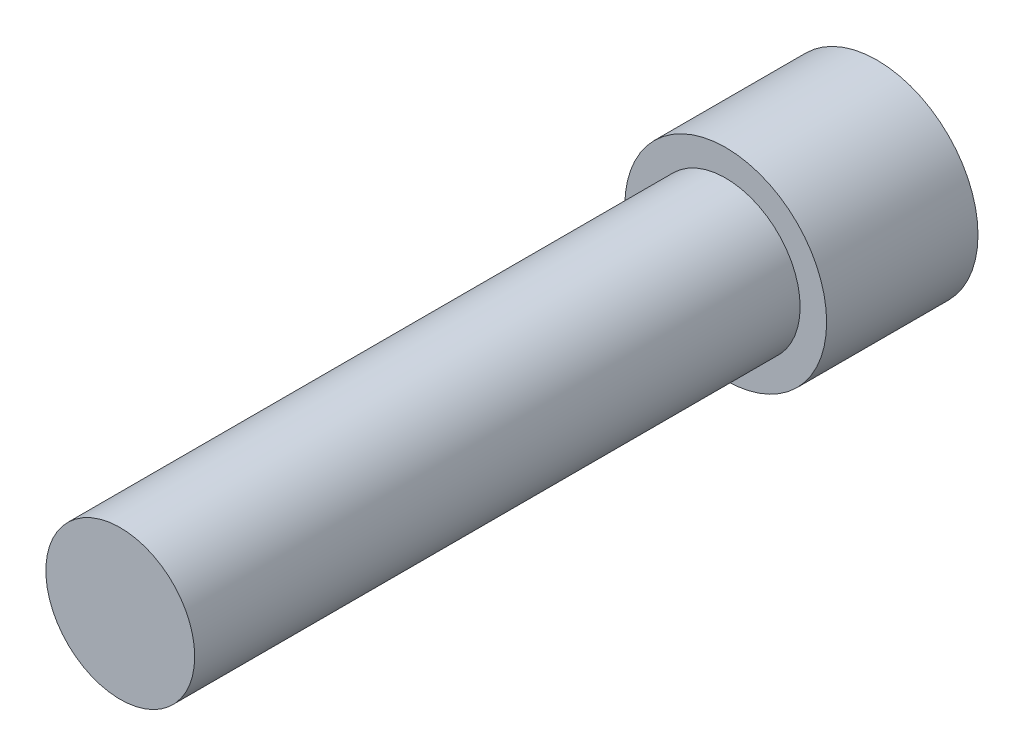
ISO-10303-21;
HEADER;
FILE_DESCRIPTION(('STEP AP214'),'2;1');
FILE_NAME('part.step','',(''),(''),'','','');
FILE_SCHEMA(('AUTOMOTIVE_DESIGN { 1 0 10303 214 1 1 1 1 }'));
ENDSEC;
DATA;
#1=APPLICATION_CONTEXT('core data for automotive mechanical design processes');
#2=APPLICATION_PROTOCOL_DEFINITION('international standard','automotive_design',2000,#1);
#3=PRODUCT_CONTEXT('',#1,'mechanical');
#4=PRODUCT('Part','Part','',(#3));
#5=PRODUCT_RELATED_PRODUCT_CATEGORY('part','',(#4));
#6=PRODUCT_DEFINITION_FORMATION('','',#4);
#7=PRODUCT_DEFINITION_CONTEXT('part definition',#1,'design');
#8=PRODUCT_DEFINITION('design','',#6,#7);
#9=PRODUCT_DEFINITION_SHAPE('','',#8);
#10=(LENGTH_UNIT() NAMED_UNIT(*) SI_UNIT(.MILLI.,.METRE.));
#11=(NAMED_UNIT(*) PLANE_ANGLE_UNIT() SI_UNIT($,.RADIAN.));
#12=(NAMED_UNIT(*) SI_UNIT($,.STERADIAN.) SOLID_ANGLE_UNIT());
#13=UNCERTAINTY_MEASURE_WITH_UNIT(LENGTH_MEASURE(1.E-05),#10,'distance_accuracy_value','');
#14=(GEOMETRIC_REPRESENTATION_CONTEXT(3) GLOBAL_UNCERTAINTY_ASSIGNED_CONTEXT((#13)) GLOBAL_UNIT_ASSIGNED_CONTEXT((#10,
#11,#12)) REPRESENTATION_CONTEXT('',''));
#15=CARTESIAN_POINT('',(0.,0.,0.));
#16=DIRECTION('',(0.,0.,1.));
#17=DIRECTION('',(1.,0.,0.));
#18=AXIS2_PLACEMENT_3D('',#15,#16,#17);
#19=CARTESIAN_POINT('',(0.,0.,3.));
#20=DIRECTION('',(0.,0.,1.));
#21=DIRECTION('',(1.,0.,0.));
#22=AXIS2_PLACEMENT_3D('',#19,#20,#21);
#23=PLANE('',#22);
#24=CARTESIAN_POINT('',(0.,0.,3.));
#25=DIRECTION('',(0.,0.,1.));
#26=DIRECTION('',(1.,0.,0.));
#27=AXIS2_PLACEMENT_3D('',#24,#25,#26);
#28=CIRCLE('',#27,2.);
#29=CARTESIAN_POINT('',(2.,0.,3.));
#30=VERTEX_POINT('',#29);
#31=EDGE_CURVE('E11',#30,#30,#28,.T.);
#32=ORIENTED_EDGE('',*,*,#31,.T.);
#33=EDGE_LOOP('',(#32));
#34=FACE_BOUND('',#33,.T.);
#35=CARTESIAN_POINT('',(0.,0.,3.));
#36=DIRECTION('',(0.,0.,1.));
#37=DIRECTION('',(1.,0.,0.));
#38=AXIS2_PLACEMENT_3D('',#35,#36,#37);
#39=CIRCLE('',#38,1.475);
#40=CARTESIAN_POINT('',(1.475,0.,3.));
#41=VERTEX_POINT('',#40);
#42=EDGE_CURVE('E150',#41,#41,#39,.T.);
#43=ORIENTED_EDGE('',*,*,#42,.F.);
#44=EDGE_LOOP('',(#43));
#45=FACE_BOUND('',#44,.T.);
#46=ADVANCED_FACE('F31',(#34,#45),#23,.T.);
#47=CARTESIAN_POINT('',(0.,0.,3.));
#48=DIRECTION('',(0.,0.,-1.));
#49=DIRECTION('',(-1.,0.,0.));
#50=AXIS2_PLACEMENT_3D('',#47,#48,#49);
#51=CYLINDRICAL_SURFACE('',#50,2.);
#52=ORIENTED_EDGE('',*,*,#31,.F.);
#53=EDGE_LOOP('',(#52));
#54=FACE_BOUND('',#53,.T.);
#55=CARTESIAN_POINT('',(0.,0.,0.));
#56=DIRECTION('',(0.,0.,1.));
#57=DIRECTION('',(1.,0.,0.));
#58=AXIS2_PLACEMENT_3D('',#55,#56,#57);
#59=CIRCLE('',#58,2.);
#60=CARTESIAN_POINT('',(2.,0.,0.));
#61=VERTEX_POINT('',#60);
#62=EDGE_CURVE('E35',#61,#61,#59,.T.);
#63=ORIENTED_EDGE('',*,*,#62,.T.);
#64=EDGE_LOOP('',(#63));
#65=FACE_BOUND('',#64,.T.);
#66=ADVANCED_FACE('F33',(#54,#65),#51,.T.);
#67=CARTESIAN_POINT('',(0.,0.,0.));
#68=DIRECTION('',(0.,0.,1.));
#69=DIRECTION('',(1.,0.,0.));
#70=AXIS2_PLACEMENT_3D('',#67,#68,#69);
#71=PLANE('',#70);
#72=DIRECTION('',(-0.5,-0.866025403784439,0.));
#73=VECTOR('',#72,1.);
#74=CARTESIAN_POINT('',(1.44337567297407,0.,0.));
#75=LINE('',#74,#73);
#76=CARTESIAN_POINT('',(1.44337567297407,0.,0.));
#77=VERTEX_POINT('',#76);
#78=CARTESIAN_POINT('',(0.721687836487033,-1.25,0.));
#79=VERTEX_POINT('',#78);
#80=EDGE_CURVE('E120',#77,#79,#75,.T.);
#81=ORIENTED_EDGE('',*,*,#80,.F.);
#82=DIRECTION('',(0.5,-0.866025403784439,0.));
#83=VECTOR('',#82,1.);
#84=CARTESIAN_POINT('',(0.721687836487033,1.25,0.));
#85=LINE('',#84,#83);
#86=CARTESIAN_POINT('',(0.721687836487033,1.25,0.));
#87=VERTEX_POINT('',#86);
#88=EDGE_CURVE('E46',#87,#77,#85,.T.);
#89=ORIENTED_EDGE('',*,*,#88,.F.);
#90=DIRECTION('',(1.,0.,0.));
#91=VECTOR('',#90,1.);
#92=CARTESIAN_POINT('',(-0.721687836487032,1.25,0.));
#93=LINE('',#92,#91);
#94=CARTESIAN_POINT('',(-0.721687836487032,1.25,0.));
#95=VERTEX_POINT('',#94);
#96=EDGE_CURVE('E130',#95,#87,#93,.T.);
#97=ORIENTED_EDGE('',*,*,#96,.F.);
#98=DIRECTION('',(0.5,0.866025403784438,0.));
#99=VECTOR('',#98,1.);
#100=CARTESIAN_POINT('',(-1.44337567297407,0.,0.));
#101=LINE('',#100,#99);
#102=CARTESIAN_POINT('',(-1.44337567297407,0.,0.));
#103=VERTEX_POINT('',#102);
#104=EDGE_CURVE('E128',#103,#95,#101,.T.);
#105=ORIENTED_EDGE('',*,*,#104,.F.);
#106=DIRECTION('',(-0.5,0.866025403784439,0.));
#107=VECTOR('',#106,1.);
#108=CARTESIAN_POINT('',(-0.721687836487033,-1.25,0.));
#109=LINE('',#108,#107);
#110=CARTESIAN_POINT('',(-0.721687836487033,-1.25,0.));
#111=VERTEX_POINT('',#110);
#112=EDGE_CURVE('E94',#111,#103,#109,.T.);
#113=ORIENTED_EDGE('',*,*,#112,.F.);
#114=DIRECTION('',(-1.,0.,0.));
#115=VECTOR('',#114,1.);
#116=CARTESIAN_POINT('',(0.721687836487033,-1.25,0.));
#117=LINE('',#116,#115);
#118=EDGE_CURVE('E124',#79,#111,#117,.T.);
#119=ORIENTED_EDGE('',*,*,#118,.F.);
#120=EDGE_LOOP('',(#81,#89,#97,#105,#113,#119));
#121=FACE_BOUND('',#120,.T.);
#122=ORIENTED_EDGE('',*,*,#62,.F.);
#123=EDGE_LOOP('',(#122));
#124=FACE_BOUND('',#123,.T.);
#125=ADVANCED_FACE('F143',(#121,#124),#71,.F.);
#126=CARTESIAN_POINT('',(0.721687836487033,1.25,1.82));
#127=DIRECTION('',(0.866025403784439,0.5,0.));
#128=DIRECTION('',(-0.5,0.866025403784439,0.));
#129=AXIS2_PLACEMENT_3D('',#126,#127,#128);
#130=PLANE('',#129);
#131=ORIENTED_EDGE('',*,*,#88,.T.);
#132=DIRECTION('',(0.,0.,-1.));
#133=VECTOR('',#132,1.);
#134=CARTESIAN_POINT('',(1.44337567297407,0.,1.82));
#135=LINE('',#134,#133);
#136=CARTESIAN_POINT('',(1.44337567297407,0.,1.82));
#137=VERTEX_POINT('',#136);
#138=EDGE_CURVE('E76',#137,#77,#135,.T.);
#139=ORIENTED_EDGE('',*,*,#138,.F.);
#140=DIRECTION('',(0.5,-0.866025403784439,0.));
#141=VECTOR('',#140,1.);
#142=CARTESIAN_POINT('',(0.721687836487033,1.25,1.82));
#143=LINE('',#142,#141);
#144=CARTESIAN_POINT('',(0.721687836487033,1.25,1.82));
#145=VERTEX_POINT('',#144);
#146=EDGE_CURVE('E132',#145,#137,#143,.T.);
#147=ORIENTED_EDGE('',*,*,#146,.F.);
#148=DIRECTION('',(0.,0.,-1.));
#149=VECTOR('',#148,1.);
#150=CARTESIAN_POINT('',(0.721687836487033,1.25,1.82));
#151=LINE('',#150,#149);
#152=EDGE_CURVE('E54',#145,#87,#151,.T.);
#153=ORIENTED_EDGE('',*,*,#152,.T.);
#154=EDGE_LOOP('',(#131,#139,#147,#153));
#155=FACE_BOUND('',#154,.T.);
#156=ADVANCED_FACE('F172',(#155),#130,.F.);
#157=CARTESIAN_POINT('',(-0.721687836487032,1.25,1.82));
#158=DIRECTION('',(0.,1.,0.));
#159=DIRECTION('',(0.,0.,1.));
#160=AXIS2_PLACEMENT_3D('',#157,#158,#159);
#161=PLANE('',#160);
#162=ORIENTED_EDGE('',*,*,#96,.T.);
#163=ORIENTED_EDGE('',*,*,#152,.F.);
#164=DIRECTION('',(1.,0.,0.));
#165=VECTOR('',#164,1.);
#166=CARTESIAN_POINT('',(-0.721687836487032,1.25,1.82));
#167=LINE('',#166,#165);
#168=CARTESIAN_POINT('',(-0.721687836487032,1.25,1.82));
#169=VERTEX_POINT('',#168);
#170=EDGE_CURVE('E106',#169,#145,#167,.T.);
#171=ORIENTED_EDGE('',*,*,#170,.F.);
#172=DIRECTION('',(0.,0.,-1.));
#173=VECTOR('',#172,1.);
#174=CARTESIAN_POINT('',(-0.721687836487032,1.25,1.82));
#175=LINE('',#174,#173);
#176=EDGE_CURVE('E98',#169,#95,#175,.T.);
#177=ORIENTED_EDGE('',*,*,#176,.T.);
#178=EDGE_LOOP('',(#162,#163,#171,#177));
#179=FACE_BOUND('',#178,.T.);
#180=ADVANCED_FACE('F178',(#179),#161,.F.);
#181=CARTESIAN_POINT('',(-1.44337567297407,0.,1.82));
#182=DIRECTION('',(-0.866025403784438,0.5,0.));
#183=DIRECTION('',(-0.5,-0.866025403784438,0.));
#184=AXIS2_PLACEMENT_3D('',#181,#182,#183);
#185=PLANE('',#184);
#186=ORIENTED_EDGE('',*,*,#104,.T.);
#187=ORIENTED_EDGE('',*,*,#176,.F.);
#188=DIRECTION('',(0.5,0.866025403784438,0.));
#189=VECTOR('',#188,1.);
#190=CARTESIAN_POINT('',(-1.44337567297407,0.,1.82));
#191=LINE('',#190,#189);
#192=CARTESIAN_POINT('',(-1.44337567297407,0.,1.82));
#193=VERTEX_POINT('',#192);
#194=EDGE_CURVE('E102',#193,#169,#191,.T.);
#195=ORIENTED_EDGE('',*,*,#194,.F.);
#196=DIRECTION('',(0.,0.,-1.));
#197=VECTOR('',#196,1.);
#198=CARTESIAN_POINT('',(-1.44337567297407,0.,1.82));
#199=LINE('',#198,#197);
#200=EDGE_CURVE('E87',#193,#103,#199,.T.);
#201=ORIENTED_EDGE('',*,*,#200,.T.);
#202=EDGE_LOOP('',(#186,#187,#195,#201));
#203=FACE_BOUND('',#202,.T.);
#204=ADVANCED_FACE('F103',(#203),#185,.F.);
#205=CARTESIAN_POINT('',(-0.721687836487033,-1.25,1.82));
#206=DIRECTION('',(-0.866025403784439,-0.5,0.));
#207=DIRECTION('',(0.5,-0.866025403784439,0.));
#208=AXIS2_PLACEMENT_3D('',#205,#206,#207);
#209=PLANE('',#208);
#210=ORIENTED_EDGE('',*,*,#112,.T.);
#211=ORIENTED_EDGE('',*,*,#200,.F.);
#212=DIRECTION('',(-0.5,0.866025403784439,0.));
#213=VECTOR('',#212,1.);
#214=CARTESIAN_POINT('',(-0.721687836487033,-1.25,1.82));
#215=LINE('',#214,#213);
#216=CARTESIAN_POINT('',(-0.721687836487033,-1.25,1.82));
#217=VERTEX_POINT('',#216);
#218=EDGE_CURVE('E91',#217,#193,#215,.T.);
#219=ORIENTED_EDGE('',*,*,#218,.F.);
#220=DIRECTION('',(0.,0.,-1.));
#221=VECTOR('',#220,1.);
#222=CARTESIAN_POINT('',(-0.721687836487033,-1.25,1.82));
#223=LINE('',#222,#221);
#224=EDGE_CURVE('E99',#217,#111,#223,.T.);
#225=ORIENTED_EDGE('',*,*,#224,.T.);
#226=EDGE_LOOP('',(#210,#211,#219,#225));
#227=FACE_BOUND('',#226,.T.);
#228=ADVANCED_FACE('F89',(#227),#209,.F.);
#229=CARTESIAN_POINT('',(0.721687836487033,-1.25,1.82));
#230=DIRECTION('',(0.,-1.,0.));
#231=DIRECTION('',(0.,0.,-1.));
#232=AXIS2_PLACEMENT_3D('',#229,#230,#231);
#233=PLANE('',#232);
#234=ORIENTED_EDGE('',*,*,#118,.T.);
#235=ORIENTED_EDGE('',*,*,#224,.F.);
#236=DIRECTION('',(-1.,0.,0.));
#237=VECTOR('',#236,1.);
#238=CARTESIAN_POINT('',(0.721687836487033,-1.25,1.82));
#239=LINE('',#238,#237);
#240=CARTESIAN_POINT('',(0.721687836487033,-1.25,1.82));
#241=VERTEX_POINT('',#240);
#242=EDGE_CURVE('E112',#241,#217,#239,.T.);
#243=ORIENTED_EDGE('',*,*,#242,.F.);
#244=DIRECTION('',(0.,0.,-1.));
#245=VECTOR('',#244,1.);
#246=CARTESIAN_POINT('',(0.721687836487033,-1.25,1.82));
#247=LINE('',#246,#245);
#248=EDGE_CURVE('E136',#241,#79,#247,.T.);
#249=ORIENTED_EDGE('',*,*,#248,.T.);
#250=EDGE_LOOP('',(#234,#235,#243,#249));
#251=FACE_BOUND('',#250,.T.);
#252=ADVANCED_FACE('F147',(#251),#233,.F.);
#253=CARTESIAN_POINT('',(1.44337567297407,0.,1.82));
#254=DIRECTION('',(0.866025403784439,-0.5,0.));
#255=DIRECTION('',(0.5,0.866025403784439,0.));
#256=AXIS2_PLACEMENT_3D('',#253,#254,#255);
#257=PLANE('',#256);
#258=ORIENTED_EDGE('',*,*,#80,.T.);
#259=ORIENTED_EDGE('',*,*,#248,.F.);
#260=DIRECTION('',(-0.5,-0.866025403784439,0.));
#261=VECTOR('',#260,1.);
#262=CARTESIAN_POINT('',(1.44337567297407,0.,1.82));
#263=LINE('',#262,#261);
#264=EDGE_CURVE('E114',#137,#241,#263,.T.);
#265=ORIENTED_EDGE('',*,*,#264,.F.);
#266=ORIENTED_EDGE('',*,*,#138,.T.);
#267=EDGE_LOOP('',(#258,#259,#265,#266));
#268=FACE_BOUND('',#267,.T.);
#269=ADVANCED_FACE('F140',(#268),#257,.F.);
#270=CARTESIAN_POINT('',(1.44337567297407,0.,1.82));
#271=DIRECTION('',(0.,0.,-1.));
#272=DIRECTION('',(-1.,0.,0.));
#273=AXIS2_PLACEMENT_3D('',#270,#271,#272);
#274=PLANE('',#273);
#275=ORIENTED_EDGE('',*,*,#146,.T.);
#276=ORIENTED_EDGE('',*,*,#264,.T.);
#277=ORIENTED_EDGE('',*,*,#242,.T.);
#278=ORIENTED_EDGE('',*,*,#218,.T.);
#279=ORIENTED_EDGE('',*,*,#194,.T.);
#280=ORIENTED_EDGE('',*,*,#170,.T.);
#281=EDGE_LOOP('',(#275,#276,#277,#278,#279,#280));
#282=FACE_BOUND('',#281,.T.);
#283=ADVANCED_FACE('F109',(#282),#274,.T.);
#284=CARTESIAN_POINT('',(0.,0.,15.));
#285=DIRECTION('',(0.,0.,-1.));
#286=DIRECTION('',(-1.,0.,0.));
#287=AXIS2_PLACEMENT_3D('',#284,#285,#286);
#288=CYLINDRICAL_SURFACE('',#287,1.475);
#289=CARTESIAN_POINT('',(0.,0.,15.));
#290=DIRECTION('',(0.,0.,1.));
#291=DIRECTION('',(1.,0.,0.));
#292=AXIS2_PLACEMENT_3D('',#289,#290,#291);
#293=CIRCLE('',#292,1.475);
#294=CARTESIAN_POINT('',(1.475,0.,15.));
#295=VERTEX_POINT('',#294);
#296=EDGE_CURVE('E121',#295,#295,#293,.T.);
#297=ORIENTED_EDGE('',*,*,#296,.F.);
#298=EDGE_LOOP('',(#297));
#299=FACE_BOUND('',#298,.T.);
#300=ORIENTED_EDGE('',*,*,#42,.T.);
#301=EDGE_LOOP('',(#300));
#302=FACE_BOUND('',#301,.T.);
#303=ADVANCED_FACE('F158',(#299,#302),#288,.T.);
#304=CARTESIAN_POINT('',(0.,0.,15.));
#305=DIRECTION('',(0.,0.,1.));
#306=DIRECTION('',(1.,0.,0.));
#307=AXIS2_PLACEMENT_3D('',#304,#305,#306);
#308=PLANE('',#307);
#309=ORIENTED_EDGE('',*,*,#296,.T.);
#310=EDGE_LOOP('',(#309));
#311=FACE_BOUND('',#310,.T.);
#312=ADVANCED_FACE('F156',(#311),#308,.T.);
#313=CLOSED_SHELL('',(#46,#66,#125,#156,#180,#204,#228,#252,#269,#283,#303,#312));
#314=MANIFOLD_SOLID_BREP('B2',#313);
#315=ADVANCED_BREP_SHAPE_REPRESENTATION('',(#18,#314),#14);
#316=SHAPE_DEFINITION_REPRESENTATION(#9,#315);
ENDSEC;
END-ISO-10303-21;
